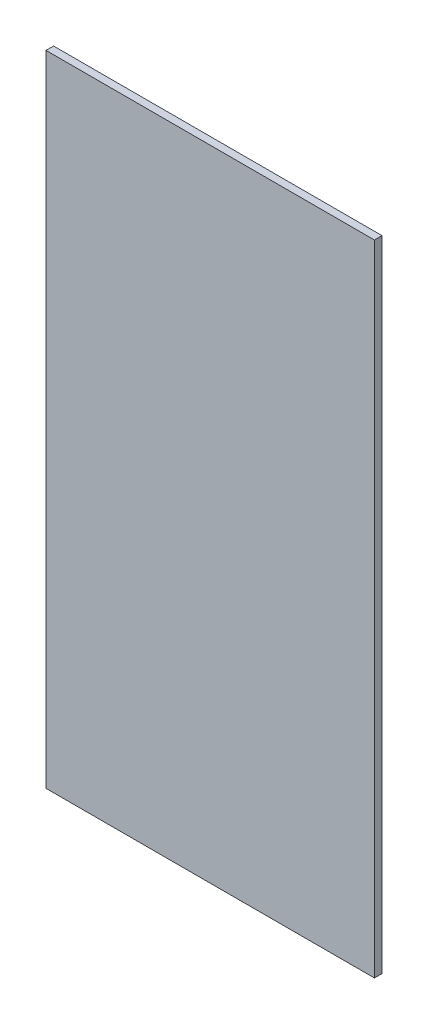
ISO-10303-21;
HEADER;
FILE_DESCRIPTION(('STEP AP214'),'2;1');
FILE_NAME('part.step','',(''),(''),'','','');
FILE_SCHEMA(('AUTOMOTIVE_DESIGN { 1 0 10303 214 1 1 1 1 }'));
ENDSEC;
DATA;
#1=APPLICATION_CONTEXT('core data for automotive mechanical design processes');
#2=APPLICATION_PROTOCOL_DEFINITION('international standard','automotive_design',2000,#1);
#3=PRODUCT_CONTEXT('',#1,'mechanical');
#4=PRODUCT('Part','Part','',(#3));
#5=PRODUCT_RELATED_PRODUCT_CATEGORY('part','',(#4));
#6=PRODUCT_DEFINITION_FORMATION('','',#4);
#7=PRODUCT_DEFINITION_CONTEXT('part definition',#1,'design');
#8=PRODUCT_DEFINITION('design','',#6,#7);
#9=PRODUCT_DEFINITION_SHAPE('','',#8);
#10=(LENGTH_UNIT() NAMED_UNIT(*) SI_UNIT(.MILLI.,.METRE.));
#11=(NAMED_UNIT(*) PLANE_ANGLE_UNIT() SI_UNIT($,.RADIAN.));
#12=(NAMED_UNIT(*) SI_UNIT($,.STERADIAN.) SOLID_ANGLE_UNIT());
#13=UNCERTAINTY_MEASURE_WITH_UNIT(LENGTH_MEASURE(1.E-05),#10,'distance_accuracy_value','');
#14=(GEOMETRIC_REPRESENTATION_CONTEXT(3) GLOBAL_UNCERTAINTY_ASSIGNED_CONTEXT((#13)) GLOBAL_UNIT_ASSIGNED_CONTEXT((#10,
#11,#12)) REPRESENTATION_CONTEXT('',''));
#15=CARTESIAN_POINT('',(0.,0.,0.));
#16=DIRECTION('',(0.,0.,1.));
#17=DIRECTION('',(1.,0.,0.));
#18=AXIS2_PLACEMENT_3D('',#15,#16,#17);
#19=CARTESIAN_POINT('',(0.,0.,6.));
#20=DIRECTION('',(1.,0.,0.));
#21=DIRECTION('',(0.,0.,-1.));
#22=AXIS2_PLACEMENT_3D('',#19,#20,#21);
#23=PLANE('',#22);
#24=DIRECTION('',(0.,-1.,0.));
#25=VECTOR('',#24,1.);
#26=CARTESIAN_POINT('',(0.,0.,0.));
#27=LINE('',#26,#25);
#28=CARTESIAN_POINT('',(0.,506.,0.));
#29=VERTEX_POINT('',#28);
#30=CARTESIAN_POINT('',(0.,0.,0.));
#31=VERTEX_POINT('',#30);
#32=EDGE_CURVE('E98',#29,#31,#27,.T.);
#33=ORIENTED_EDGE('',*,*,#32,.T.);
#34=DIRECTION('',(0.,0.,-1.));
#35=VECTOR('',#34,1.);
#36=CARTESIAN_POINT('',(0.,0.,6.));
#37=LINE('',#36,#35);
#38=CARTESIAN_POINT('',(0.,0.,6.));
#39=VERTEX_POINT('',#38);
#40=EDGE_CURVE('E11',#39,#31,#37,.T.);
#41=ORIENTED_EDGE('',*,*,#40,.F.);
#42=DIRECTION('',(0.,-1.,0.));
#43=VECTOR('',#42,1.);
#44=CARTESIAN_POINT('',(0.,0.,6.));
#45=LINE('',#44,#43);
#46=CARTESIAN_POINT('',(0.,506.,6.));
#47=VERTEX_POINT('',#46);
#48=EDGE_CURVE('E86',#47,#39,#45,.T.);
#49=ORIENTED_EDGE('',*,*,#48,.F.);
#50=DIRECTION('',(0.,0.,-1.));
#51=VECTOR('',#50,1.);
#52=CARTESIAN_POINT('',(0.,506.,6.));
#53=LINE('',#52,#51);
#54=EDGE_CURVE('E94',#47,#29,#53,.T.);
#55=ORIENTED_EDGE('',*,*,#54,.T.);
#56=EDGE_LOOP('',(#33,#41,#49,#55));
#57=FACE_BOUND('',#56,.T.);
#58=ADVANCED_FACE('F35',(#57),#23,.F.);
#59=CARTESIAN_POINT('',(0.,0.,6.));
#60=DIRECTION('',(0.,1.,0.));
#61=DIRECTION('',(0.,0.,1.));
#62=AXIS2_PLACEMENT_3D('',#59,#60,#61);
#63=PLANE('',#62);
#64=DIRECTION('',(1.,0.,0.));
#65=VECTOR('',#64,1.);
#66=CARTESIAN_POINT('',(0.,0.,0.));
#67=LINE('',#66,#65);
#68=CARTESIAN_POINT('',(260.,0.,0.));
#69=VERTEX_POINT('',#68);
#70=EDGE_CURVE('E90',#31,#69,#67,.T.);
#71=ORIENTED_EDGE('',*,*,#70,.T.);
#72=DIRECTION('',(0.,0.,-1.));
#73=VECTOR('',#72,1.);
#74=CARTESIAN_POINT('',(260.,0.,6.));
#75=LINE('',#74,#73);
#76=CARTESIAN_POINT('',(260.,0.,6.));
#77=VERTEX_POINT('',#76);
#78=EDGE_CURVE('E43',#77,#69,#75,.T.);
#79=ORIENTED_EDGE('',*,*,#78,.F.);
#80=DIRECTION('',(1.,0.,0.));
#81=VECTOR('',#80,1.);
#82=CARTESIAN_POINT('',(0.,0.,6.));
#83=LINE('',#82,#81);
#84=EDGE_CURVE('E81',#39,#77,#83,.T.);
#85=ORIENTED_EDGE('',*,*,#84,.F.);
#86=ORIENTED_EDGE('',*,*,#40,.T.);
#87=EDGE_LOOP('',(#71,#79,#85,#86));
#88=FACE_BOUND('',#87,.T.);
#89=ADVANCED_FACE('F89',(#88),#63,.F.);
#90=CARTESIAN_POINT('',(260.,0.,6.));
#91=DIRECTION('',(-1.,0.,0.));
#92=DIRECTION('',(0.,0.,1.));
#93=AXIS2_PLACEMENT_3D('',#90,#91,#92);
#94=PLANE('',#93);
#95=DIRECTION('',(0.,1.,0.));
#96=VECTOR('',#95,1.);
#97=CARTESIAN_POINT('',(260.,0.,0.));
#98=LINE('',#97,#96);
#99=CARTESIAN_POINT('',(260.,506.,0.));
#100=VERTEX_POINT('',#99);
#101=EDGE_CURVE('E68',#69,#100,#98,.T.);
#102=ORIENTED_EDGE('',*,*,#101,.T.);
#103=DIRECTION('',(0.,0.,-1.));
#104=VECTOR('',#103,1.);
#105=CARTESIAN_POINT('',(260.,506.,6.));
#106=LINE('',#105,#104);
#107=CARTESIAN_POINT('',(260.,506.,6.));
#108=VERTEX_POINT('',#107);
#109=EDGE_CURVE('E91',#108,#100,#106,.T.);
#110=ORIENTED_EDGE('',*,*,#109,.F.);
#111=DIRECTION('',(0.,1.,0.));
#112=VECTOR('',#111,1.);
#113=CARTESIAN_POINT('',(260.,0.,6.));
#114=LINE('',#113,#112);
#115=EDGE_CURVE('E84',#77,#108,#114,.T.);
#116=ORIENTED_EDGE('',*,*,#115,.F.);
#117=ORIENTED_EDGE('',*,*,#78,.T.);
#118=EDGE_LOOP('',(#102,#110,#116,#117));
#119=FACE_BOUND('',#118,.T.);
#120=ADVANCED_FACE('F92',(#119),#94,.F.);
#121=CARTESIAN_POINT('',(0.,506.,6.));
#122=DIRECTION('',(0.,-1.,0.));
#123=DIRECTION('',(0.,0.,-1.));
#124=AXIS2_PLACEMENT_3D('',#121,#122,#123);
#125=PLANE('',#124);
#126=DIRECTION('',(-1.,0.,0.));
#127=VECTOR('',#126,1.);
#128=CARTESIAN_POINT('',(0.,506.,0.));
#129=LINE('',#128,#127);
#130=EDGE_CURVE('E74',#100,#29,#129,.T.);
#131=ORIENTED_EDGE('',*,*,#130,.T.);
#132=ORIENTED_EDGE('',*,*,#54,.F.);
#133=DIRECTION('',(-1.,0.,0.));
#134=VECTOR('',#133,1.);
#135=CARTESIAN_POINT('',(0.,506.,6.));
#136=LINE('',#135,#134);
#137=EDGE_CURVE('E51',#108,#47,#136,.T.);
#138=ORIENTED_EDGE('',*,*,#137,.F.);
#139=ORIENTED_EDGE('',*,*,#109,.T.);
#140=EDGE_LOOP('',(#131,#132,#138,#139));
#141=FACE_BOUND('',#140,.T.);
#142=ADVANCED_FACE('F105',(#141),#125,.F.);
#143=CARTESIAN_POINT('',(0.,0.,6.));
#144=DIRECTION('',(0.,0.,-1.));
#145=DIRECTION('',(-1.,0.,0.));
#146=AXIS2_PLACEMENT_3D('',#143,#144,#145);
#147=PLANE('',#146);
#148=ORIENTED_EDGE('',*,*,#48,.T.);
#149=ORIENTED_EDGE('',*,*,#84,.T.);
#150=ORIENTED_EDGE('',*,*,#115,.T.);
#151=ORIENTED_EDGE('',*,*,#137,.T.);
#152=EDGE_LOOP('',(#148,#149,#150,#151));
#153=FACE_BOUND('',#152,.T.);
#154=ADVANCED_FACE('F82',(#153),#147,.F.);
#155=CARTESIAN_POINT('',(0.,0.,0.));
#156=DIRECTION('',(0.,0.,-1.));
#157=DIRECTION('',(-1.,0.,0.));
#158=AXIS2_PLACEMENT_3D('',#155,#156,#157);
#159=PLANE('',#158);
#160=ORIENTED_EDGE('',*,*,#32,.F.);
#161=ORIENTED_EDGE('',*,*,#130,.F.);
#162=ORIENTED_EDGE('',*,*,#101,.F.);
#163=ORIENTED_EDGE('',*,*,#70,.F.);
#164=EDGE_LOOP('',(#160,#161,#162,#163));
#165=FACE_BOUND('',#164,.T.);
#166=ADVANCED_FACE('F108',(#165),#159,.T.);
#167=CLOSED_SHELL('',(#58,#89,#120,#142,#154,#166));
#168=MANIFOLD_SOLID_BREP('B2',#167);
#169=ADVANCED_BREP_SHAPE_REPRESENTATION('',(#18,#168),#14);
#170=SHAPE_DEFINITION_REPRESENTATION(#9,#169);
ENDSEC;
END-ISO-10303-21;
